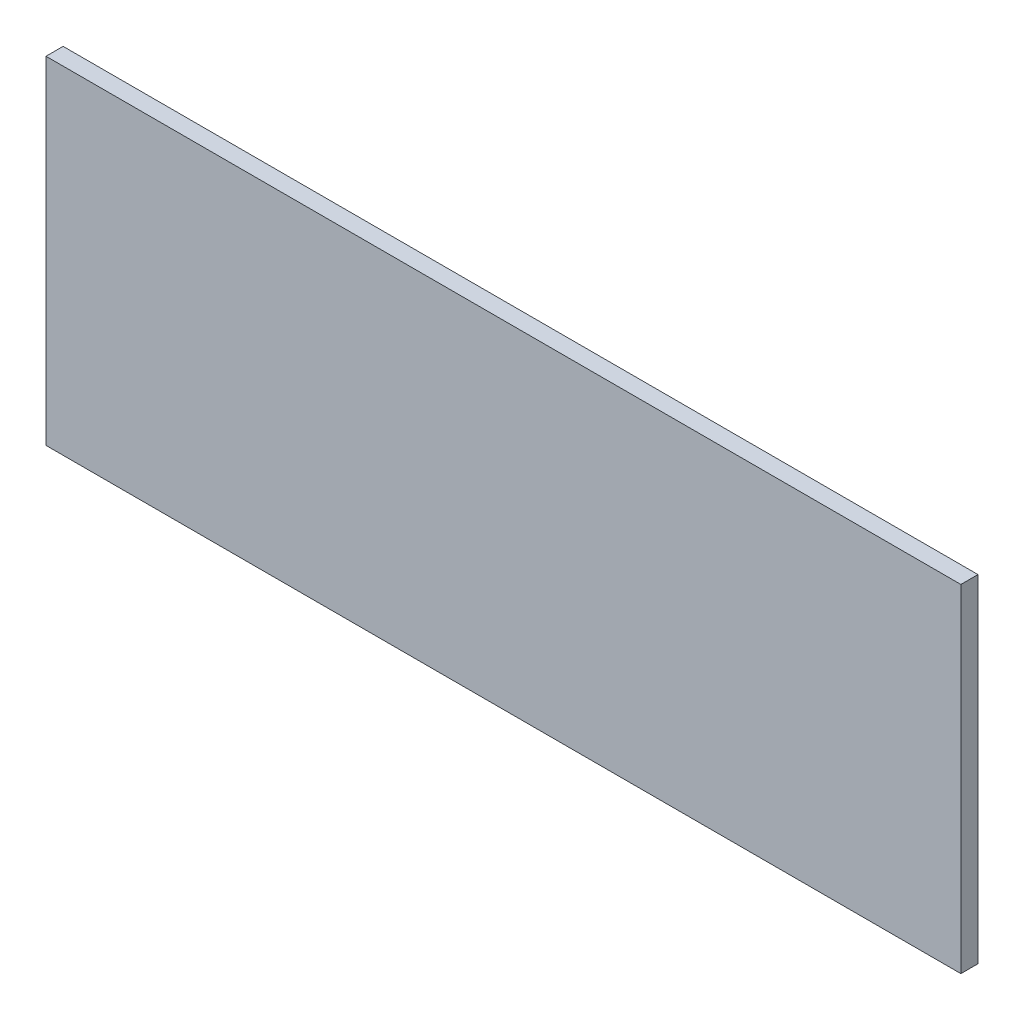
ISO-10303-21;
HEADER;
FILE_DESCRIPTION(('STEP AP214'),'2;1');
FILE_NAME('part.step','',(''),(''),'','','');
FILE_SCHEMA(('AUTOMOTIVE_DESIGN { 1 0 10303 214 1 1 1 1 }'));
ENDSEC;
DATA;
#1=APPLICATION_CONTEXT('core data for automotive mechanical design processes');
#2=APPLICATION_PROTOCOL_DEFINITION('international standard','automotive_design',2000,#1);
#3=PRODUCT_CONTEXT('',#1,'mechanical');
#4=PRODUCT('Part','Part','',(#3));
#5=PRODUCT_RELATED_PRODUCT_CATEGORY('part','',(#4));
#6=PRODUCT_DEFINITION_FORMATION('','',#4);
#7=PRODUCT_DEFINITION_CONTEXT('part definition',#1,'design');
#8=PRODUCT_DEFINITION('design','',#6,#7);
#9=PRODUCT_DEFINITION_SHAPE('','',#8);
#10=(LENGTH_UNIT() NAMED_UNIT(*) SI_UNIT(.MILLI.,.METRE.));
#11=(NAMED_UNIT(*) PLANE_ANGLE_UNIT() SI_UNIT($,.RADIAN.));
#12=(NAMED_UNIT(*) SI_UNIT($,.STERADIAN.) SOLID_ANGLE_UNIT());
#13=UNCERTAINTY_MEASURE_WITH_UNIT(LENGTH_MEASURE(1.E-05),#10,'distance_accuracy_value','');
#14=(GEOMETRIC_REPRESENTATION_CONTEXT(3) GLOBAL_UNCERTAINTY_ASSIGNED_CONTEXT((#13)) GLOBAL_UNIT_ASSIGNED_CONTEXT((#10,
#11,#12)) REPRESENTATION_CONTEXT('',''));
#15=CARTESIAN_POINT('',(0.,0.,0.));
#16=DIRECTION('',(0.,0.,1.));
#17=DIRECTION('',(1.,0.,0.));
#18=AXIS2_PLACEMENT_3D('',#15,#16,#17);
#19=CARTESIAN_POINT('',(96.5670013427734,56.3370018005371,0.));
#20=DIRECTION('',(0.,1.,0.));
#21=DIRECTION('',(1.,0.,0.));
#22=AXIS2_PLACEMENT_3D('',#19,#20,#21);
#23=PLANE('',#22);
#24=DIRECTION('',(1.,0.,0.));
#25=VECTOR('',#24,1.);
#26=CARTESIAN_POINT('',(96.5670013427734,56.3370018005371,0.03556));
#27=LINE('',#26,#25);
#28=CARTESIAN_POINT('',(96.5670013427734,56.3370018005371,0.03556));
#29=VERTEX_POINT('',#28);
#30=CARTESIAN_POINT('',(98.4670028686523,56.3370018005371,0.03556));
#31=VERTEX_POINT('',#30);
#32=EDGE_CURVE('E11',#29,#31,#27,.T.);
#33=ORIENTED_EDGE('',*,*,#32,.F.);
#34=DIRECTION('',(0.,0.,1.));
#35=VECTOR('',#34,1.);
#36=CARTESIAN_POINT('',(96.5670013427734,56.3370018005371,0.));
#37=LINE('',#36,#35);
#38=CARTESIAN_POINT('',(96.5670013427734,56.3370018005371,0.));
#39=VERTEX_POINT('',#38);
#40=EDGE_CURVE('E24',#39,#29,#37,.T.);
#41=ORIENTED_EDGE('',*,*,#40,.F.);
#42=DIRECTION('',(1.,0.,0.));
#43=VECTOR('',#42,1.);
#44=CARTESIAN_POINT('',(96.5670013427734,56.3370018005371,0.));
#45=LINE('',#44,#43);
#46=CARTESIAN_POINT('',(98.4670028686523,56.3370018005371,0.));
#47=VERTEX_POINT('',#46);
#48=EDGE_CURVE('E75',#39,#47,#45,.T.);
#49=ORIENTED_EDGE('',*,*,#48,.T.);
#50=DIRECTION('',(0.,0.,1.));
#51=VECTOR('',#50,1.);
#52=CARTESIAN_POINT('',(98.4670028686523,56.3370018005371,0.));
#53=LINE('',#52,#51);
#54=EDGE_CURVE('E37',#47,#31,#53,.T.);
#55=ORIENTED_EDGE('',*,*,#54,.T.);
#56=EDGE_LOOP('',(#33,#41,#49,#55));
#57=FACE_BOUND('',#56,.T.);
#58=ADVANCED_FACE('F17',(#57),#23,.F.);
#59=CARTESIAN_POINT('',(98.4670028686523,56.3370018005371,0.));
#60=DIRECTION('',(-1.,0.,0.));
#61=DIRECTION('',(0.,1.,0.));
#62=AXIS2_PLACEMENT_3D('',#59,#60,#61);
#63=PLANE('',#62);
#64=DIRECTION('',(0.,1.,0.));
#65=VECTOR('',#64,1.);
#66=CARTESIAN_POINT('',(98.4670028686523,56.3370018005371,0.03556));
#67=LINE('',#66,#65);
#68=CARTESIAN_POINT('',(98.4670028686523,57.0369987487793,0.03556));
#69=VERTEX_POINT('',#68);
#70=EDGE_CURVE('E83',#31,#69,#67,.T.);
#71=ORIENTED_EDGE('',*,*,#70,.F.);
#72=ORIENTED_EDGE('',*,*,#54,.F.);
#73=DIRECTION('',(0.,1.,0.));
#74=VECTOR('',#73,1.);
#75=CARTESIAN_POINT('',(98.4670028686523,56.3370018005371,0.));
#76=LINE('',#75,#74);
#77=CARTESIAN_POINT('',(98.4670028686523,57.0369987487793,0.));
#78=VERTEX_POINT('',#77);
#79=EDGE_CURVE('E81',#47,#78,#76,.T.);
#80=ORIENTED_EDGE('',*,*,#79,.T.);
#81=DIRECTION('',(0.,0.,1.));
#82=VECTOR('',#81,1.);
#83=CARTESIAN_POINT('',(98.4670028686523,57.0369987487793,0.));
#84=LINE('',#83,#82);
#85=EDGE_CURVE('E67',#78,#69,#84,.T.);
#86=ORIENTED_EDGE('',*,*,#85,.T.);
#87=EDGE_LOOP('',(#71,#72,#80,#86));
#88=FACE_BOUND('',#87,.T.);
#89=ADVANCED_FACE('F89',(#88),#63,.F.);
#90=CARTESIAN_POINT('',(98.4670028686523,57.0369987487793,0.));
#91=DIRECTION('',(0.,-1.,0.));
#92=DIRECTION('',(-1.,0.,0.));
#93=AXIS2_PLACEMENT_3D('',#90,#91,#92);
#94=PLANE('',#93);
#95=DIRECTION('',(-1.,0.,0.));
#96=VECTOR('',#95,1.);
#97=CARTESIAN_POINT('',(98.4670028686523,57.0369987487793,0.03556));
#98=LINE('',#97,#96);
#99=CARTESIAN_POINT('',(96.5670013427734,57.0369987487793,0.03556));
#100=VERTEX_POINT('',#99);
#101=EDGE_CURVE('E71',#69,#100,#98,.T.);
#102=ORIENTED_EDGE('',*,*,#101,.F.);
#103=ORIENTED_EDGE('',*,*,#85,.F.);
#104=DIRECTION('',(-1.,0.,0.));
#105=VECTOR('',#104,1.);
#106=CARTESIAN_POINT('',(98.4670028686523,57.0369987487793,0.));
#107=LINE('',#106,#105);
#108=CARTESIAN_POINT('',(96.5670013427734,57.0369987487793,0.));
#109=VERTEX_POINT('',#108);
#110=EDGE_CURVE('E63',#78,#109,#107,.T.);
#111=ORIENTED_EDGE('',*,*,#110,.T.);
#112=DIRECTION('',(0.,0.,1.));
#113=VECTOR('',#112,1.);
#114=CARTESIAN_POINT('',(96.5670013427734,57.0369987487793,0.));
#115=LINE('',#114,#113);
#116=EDGE_CURVE('E53',#109,#100,#115,.T.);
#117=ORIENTED_EDGE('',*,*,#116,.T.);
#118=EDGE_LOOP('',(#102,#103,#111,#117));
#119=FACE_BOUND('',#118,.T.);
#120=ADVANCED_FACE('F66',(#119),#94,.F.);
#121=CARTESIAN_POINT('',(96.5670013427734,57.0369987487793,0.));
#122=DIRECTION('',(1.,0.,0.));
#123=DIRECTION('',(0.,-1.,0.));
#124=AXIS2_PLACEMENT_3D('',#121,#122,#123);
#125=PLANE('',#124);
#126=DIRECTION('',(0.,-1.,0.));
#127=VECTOR('',#126,1.);
#128=CARTESIAN_POINT('',(96.5670013427734,57.0369987487793,0.03556));
#129=LINE('',#128,#127);
#130=EDGE_CURVE('E59',#100,#29,#129,.T.);
#131=ORIENTED_EDGE('',*,*,#130,.F.);
#132=ORIENTED_EDGE('',*,*,#116,.F.);
#133=DIRECTION('',(0.,-1.,0.));
#134=VECTOR('',#133,1.);
#135=CARTESIAN_POINT('',(96.5670013427734,57.0369987487793,0.));
#136=LINE('',#135,#134);
#137=EDGE_CURVE('E57',#109,#39,#136,.T.);
#138=ORIENTED_EDGE('',*,*,#137,.T.);
#139=ORIENTED_EDGE('',*,*,#40,.T.);
#140=EDGE_LOOP('',(#131,#132,#138,#139));
#141=FACE_BOUND('',#140,.T.);
#142=ADVANCED_FACE('F55',(#141),#125,.F.);
#143=CARTESIAN_POINT('',(96.5670013427734,56.3370018005371,0.));
#144=DIRECTION('',(0.,0.,-1.));
#145=DIRECTION('',(-1.,0.,0.));
#146=AXIS2_PLACEMENT_3D('',#143,#144,#145);
#147=PLANE('',#146);
#148=ORIENTED_EDGE('',*,*,#137,.F.);
#149=ORIENTED_EDGE('',*,*,#110,.F.);
#150=ORIENTED_EDGE('',*,*,#79,.F.);
#151=ORIENTED_EDGE('',*,*,#48,.F.);
#152=EDGE_LOOP('',(#148,#149,#150,#151));
#153=FACE_BOUND('',#152,.T.);
#154=ADVANCED_FACE('F74',(#153),#147,.T.);
#155=CARTESIAN_POINT('',(96.5670013427734,56.3370018005371,0.03556));
#156=DIRECTION('',(0.,0.,-1.));
#157=DIRECTION('',(-1.,0.,0.));
#158=AXIS2_PLACEMENT_3D('',#155,#156,#157);
#159=PLANE('',#158);
#160=ORIENTED_EDGE('',*,*,#32,.T.);
#161=ORIENTED_EDGE('',*,*,#70,.T.);
#162=ORIENTED_EDGE('',*,*,#101,.T.);
#163=ORIENTED_EDGE('',*,*,#130,.T.);
#164=EDGE_LOOP('',(#160,#161,#162,#163));
#165=FACE_BOUND('',#164,.T.);
#166=ADVANCED_FACE('F91',(#165),#159,.F.);
#167=CLOSED_SHELL('',(#58,#89,#120,#142,#154,#166));
#168=MANIFOLD_SOLID_BREP('B1',#167);
#169=ADVANCED_BREP_SHAPE_REPRESENTATION('',(#18,#168),#14);
#170=SHAPE_DEFINITION_REPRESENTATION(#9,#169);
ENDSEC;
END-ISO-10303-21;
